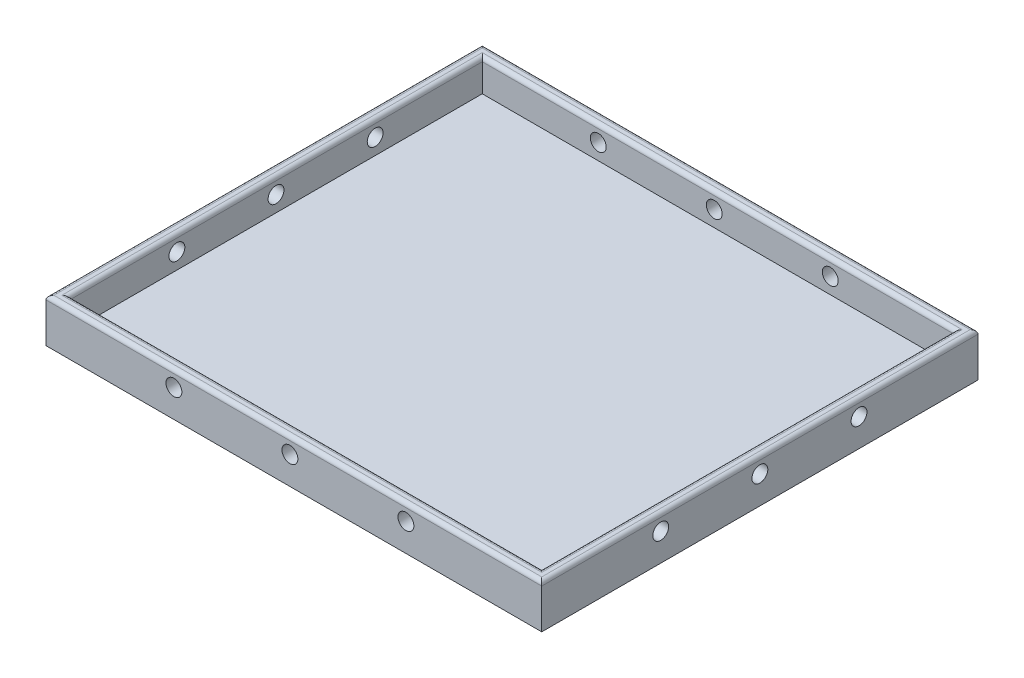
ISO-10303-21;
HEADER;
FILE_DESCRIPTION(('STEP AP214'),'2;1');
FILE_NAME('part.step','',(''),(''),'','','');
FILE_SCHEMA(('AUTOMOTIVE_DESIGN { 1 0 10303 214 1 1 1 1 }'));
ENDSEC;
DATA;
#1=APPLICATION_CONTEXT('core data for automotive mechanical design processes');
#2=APPLICATION_PROTOCOL_DEFINITION('international standard','automotive_design',2000,#1);
#3=PRODUCT_CONTEXT('',#1,'mechanical');
#4=PRODUCT('Part','Part','',(#3));
#5=PRODUCT_RELATED_PRODUCT_CATEGORY('part','',(#4));
#6=PRODUCT_DEFINITION_FORMATION('','',#4);
#7=PRODUCT_DEFINITION_CONTEXT('part definition',#1,'design');
#8=PRODUCT_DEFINITION('design','',#6,#7);
#9=PRODUCT_DEFINITION_SHAPE('','',#8);
#10=(LENGTH_UNIT() NAMED_UNIT(*) SI_UNIT(.MILLI.,.METRE.));
#11=(NAMED_UNIT(*) PLANE_ANGLE_UNIT() SI_UNIT($,.RADIAN.));
#12=(NAMED_UNIT(*) SI_UNIT($,.STERADIAN.) SOLID_ANGLE_UNIT());
#13=UNCERTAINTY_MEASURE_WITH_UNIT(LENGTH_MEASURE(1.E-05),#10,'distance_accuracy_value','');
#14=(GEOMETRIC_REPRESENTATION_CONTEXT(3) GLOBAL_UNCERTAINTY_ASSIGNED_CONTEXT((#13)) GLOBAL_UNIT_ASSIGNED_CONTEXT((#10,
#11,#12)) REPRESENTATION_CONTEXT('',''));
#15=CARTESIAN_POINT('',(0.,0.,0.));
#16=DIRECTION('',(0.,0.,1.));
#17=DIRECTION('',(1.,0.,0.));
#18=AXIS2_PLACEMENT_3D('',#15,#16,#17);
#19=CARTESIAN_POINT('',(-201.609907120743,11.,-77.8947368421052));
#20=DIRECTION('',(1.,0.,0.));
#21=DIRECTION('',(0.,0.,-1.));
#22=AXIS2_PLACEMENT_3D('',#19,#20,#21);
#23=PLANE('',#22);
#24=CARTESIAN_POINT('',(-201.609907120743,6.99999995326219,2.10526315789477));
#25=DIRECTION('',(1.,0.,0.));
#26=DIRECTION('',(0.,0.,-1.));
#27=AXIS2_PLACEMENT_3D('',#24,#25,#26);
#28=CIRCLE('',#27,2.);
#29=CARTESIAN_POINT('',(-201.609907120743,6.99999995326219,0.105263157894766));
#30=VERTEX_POINT('',#29);
#31=EDGE_CURVE('E191',#30,#30,#28,.T.);
#32=ORIENTED_EDGE('',*,*,#31,.T.);
#33=EDGE_LOOP('',(#32));
#34=FACE_BOUND('',#33,.T.);
#35=CARTESIAN_POINT('',(-201.609907120743,6.99999995326219,-22.8947368421052));
#36=DIRECTION('',(1.,0.,0.));
#37=DIRECTION('',(0.,0.,-1.));
#38=AXIS2_PLACEMENT_3D('',#35,#36,#37);
#39=CIRCLE('',#38,2.);
#40=CARTESIAN_POINT('',(-201.609907120743,6.99999995326219,-24.8947368421052));
#41=VERTEX_POINT('',#40);
#42=EDGE_CURVE('E594',#41,#41,#39,.T.);
#43=ORIENTED_EDGE('',*,*,#42,.T.);
#44=EDGE_LOOP('',(#43));
#45=FACE_BOUND('',#44,.T.);
#46=CARTESIAN_POINT('',(-201.609907120743,7.,-47.8947368421052));
#47=DIRECTION('',(1.,0.,0.));
#48=DIRECTION('',(0.,0.,-1.));
#49=AXIS2_PLACEMENT_3D('',#46,#47,#48);
#50=CIRCLE('',#49,2.);
#51=CARTESIAN_POINT('',(-201.609907120743,7.,-49.8947368421052));
#52=VERTEX_POINT('',#51);
#53=EDGE_CURVE('E587',#52,#52,#50,.T.);
#54=ORIENTED_EDGE('',*,*,#53,.T.);
#55=EDGE_LOOP('',(#54));
#56=FACE_BOUND('',#55,.T.);
#57=DIRECTION('',(0.,-1.,0.));
#58=VECTOR('',#57,1.);
#59=CARTESIAN_POINT('',(-201.609907120743,11.,32.1052631578948));
#60=LINE('',#59,#58);
#61=CARTESIAN_POINT('',(-201.609907120743,10.,32.1052631578948));
#62=VERTEX_POINT('',#61);
#63=CARTESIAN_POINT('',(-201.609907120743,0.,32.1052631578948));
#64=VERTEX_POINT('',#63);
#65=EDGE_CURVE('E184',#62,#64,#60,.T.);
#66=ORIENTED_EDGE('',*,*,#65,.F.);
#67=DIRECTION('',(0.,0.,1.));
#68=VECTOR('',#67,1.);
#69=CARTESIAN_POINT('',(-201.609907120743,10.,-77.8947368421052));
#70=LINE('',#69,#68);
#71=CARTESIAN_POINT('',(-201.609907120743,10.,-77.8947368421052));
#72=VERTEX_POINT('',#71);
#73=EDGE_CURVE('E45',#62,#72,#70,.F.);
#74=ORIENTED_EDGE('',*,*,#73,.T.);
#75=DIRECTION('',(0.,-1.,0.));
#76=VECTOR('',#75,1.);
#77=CARTESIAN_POINT('',(-201.609907120743,11.,-77.8947368421052));
#78=LINE('',#77,#76);
#79=CARTESIAN_POINT('',(-201.609907120743,0.,-77.8947368421052));
#80=VERTEX_POINT('',#79);
#81=EDGE_CURVE('E178',#72,#80,#78,.T.);
#82=ORIENTED_EDGE('',*,*,#81,.T.);
#83=DIRECTION('',(0.,0.,1.));
#84=VECTOR('',#83,1.);
#85=CARTESIAN_POINT('',(-201.609907120743,0.,-77.8947368421052));
#86=LINE('',#85,#84);
#87=EDGE_CURVE('E163',#80,#64,#86,.T.);
#88=ORIENTED_EDGE('',*,*,#87,.T.);
#89=EDGE_LOOP('',(#66,#74,#82,#88));
#90=FACE_BOUND('',#89,.T.);
#91=ADVANCED_FACE('F36',(#34,#45,#56,#90),#23,.F.);
#92=CARTESIAN_POINT('',(-201.609907120743,11.,32.1052631578948));
#93=DIRECTION('',(0.,0.,-1.));
#94=DIRECTION('',(-1.,0.,0.));
#95=AXIS2_PLACEMENT_3D('',#92,#93,#94);
#96=PLANE('',#95);
#97=CARTESIAN_POINT('',(-169.359907120743,7.,32.1052631578948));
#98=DIRECTION('',(0.,0.,1.));
#99=DIRECTION('',(1.,0.,0.));
#100=AXIS2_PLACEMENT_3D('',#97,#98,#99);
#101=CIRCLE('',#100,2.);
#102=CARTESIAN_POINT('',(-167.359907120743,7.,32.1052631578948));
#103=VERTEX_POINT('',#102);
#104=EDGE_CURVE('E622',#103,#103,#101,.T.);
#105=ORIENTED_EDGE('',*,*,#104,.F.);
#106=EDGE_LOOP('',(#105));
#107=FACE_BOUND('',#106,.T.);
#108=CARTESIAN_POINT('',(-140.109907120743,7.,32.1052631578948));
#109=DIRECTION('',(0.,0.,1.));
#110=DIRECTION('',(1.,0.,0.));
#111=AXIS2_PLACEMENT_3D('',#108,#109,#110);
#112=CIRCLE('',#111,2.);
#113=CARTESIAN_POINT('',(-138.109907120743,7.,32.1052631578948));
#114=VERTEX_POINT('',#113);
#115=EDGE_CURVE('E616',#114,#114,#112,.T.);
#116=ORIENTED_EDGE('',*,*,#115,.F.);
#117=EDGE_LOOP('',(#116));
#118=FACE_BOUND('',#117,.T.);
#119=CARTESIAN_POINT('',(-110.859907120743,7.,32.1052631578948));
#120=DIRECTION('',(0.,0.,1.));
#121=DIRECTION('',(1.,0.,0.));
#122=AXIS2_PLACEMENT_3D('',#119,#120,#121);
#123=CIRCLE('',#122,2.);
#124=CARTESIAN_POINT('',(-108.859907120743,7.,32.1052631578948));
#125=VERTEX_POINT('',#124);
#126=EDGE_CURVE('E250',#125,#125,#123,.T.);
#127=ORIENTED_EDGE('',*,*,#126,.F.);
#128=EDGE_LOOP('',(#127));
#129=FACE_BOUND('',#128,.T.);
#130=DIRECTION('',(0.,-1.,0.));
#131=VECTOR('',#130,1.);
#132=CARTESIAN_POINT('',(-76.6099071207431,11.,32.1052631578948));
#133=LINE('',#132,#131);
#134=CARTESIAN_POINT('',(-76.6099071207431,10.,32.1052631578948));
#135=VERTEX_POINT('',#134);
#136=CARTESIAN_POINT('',(-76.6099071207431,0.,32.1052631578948));
#137=VERTEX_POINT('',#136);
#138=EDGE_CURVE('E182',#135,#137,#133,.T.);
#139=ORIENTED_EDGE('',*,*,#138,.F.);
#140=DIRECTION('',(1.,0.,0.));
#141=VECTOR('',#140,1.);
#142=CARTESIAN_POINT('',(-201.609907120743,10.,32.1052631578948));
#143=LINE('',#142,#141);
#144=EDGE_CURVE('E230',#135,#62,#143,.F.);
#145=ORIENTED_EDGE('',*,*,#144,.T.);
#146=ORIENTED_EDGE('',*,*,#65,.T.);
#147=DIRECTION('',(1.,0.,0.));
#148=VECTOR('',#147,1.);
#149=CARTESIAN_POINT('',(-201.609907120743,0.,32.1052631578948));
#150=LINE('',#149,#148);
#151=EDGE_CURVE('E169',#64,#137,#150,.T.);
#152=ORIENTED_EDGE('',*,*,#151,.T.);
#153=EDGE_LOOP('',(#139,#145,#146,#152));
#154=FACE_BOUND('',#153,.T.);
#155=ADVANCED_FACE('F282',(#107,#118,#129,#154),#96,.F.);
#156=CARTESIAN_POINT('',(-76.6099071207431,11.,-77.8947368421052));
#157=DIRECTION('',(-1.,0.,0.));
#158=DIRECTION('',(0.,0.,1.));
#159=AXIS2_PLACEMENT_3D('',#156,#157,#158);
#160=PLANE('',#159);
#161=CARTESIAN_POINT('',(-76.6099071207431,6.99999995326219,2.10526315789477));
#162=DIRECTION('',(1.,0.,0.));
#163=DIRECTION('',(0.,0.,-1.));
#164=AXIS2_PLACEMENT_3D('',#161,#162,#163);
#165=CIRCLE('',#164,2.);
#166=CARTESIAN_POINT('',(-76.6099071207431,6.99999995326219,0.105263157894766));
#167=VERTEX_POINT('',#166);
#168=EDGE_CURVE('E579',#167,#167,#165,.T.);
#169=ORIENTED_EDGE('',*,*,#168,.F.);
#170=EDGE_LOOP('',(#169));
#171=FACE_BOUND('',#170,.T.);
#172=CARTESIAN_POINT('',(-76.6099071207431,6.99999995326219,-22.8947368421052));
#173=DIRECTION('',(1.,0.,0.));
#174=DIRECTION('',(0.,0.,-1.));
#175=AXIS2_PLACEMENT_3D('',#172,#173,#174);
#176=CIRCLE('',#175,2.);
#177=CARTESIAN_POINT('',(-76.6099071207431,6.99999995326219,-24.8947368421052));
#178=VERTEX_POINT('',#177);
#179=EDGE_CURVE('E583',#178,#178,#176,.T.);
#180=ORIENTED_EDGE('',*,*,#179,.F.);
#181=EDGE_LOOP('',(#180));
#182=FACE_BOUND('',#181,.T.);
#183=CARTESIAN_POINT('',(-76.6099071207431,7.,-47.8947368421052));
#184=DIRECTION('',(1.,0.,0.));
#185=DIRECTION('',(0.,0.,-1.));
#186=AXIS2_PLACEMENT_3D('',#183,#184,#185);
#187=CIRCLE('',#186,2.);
#188=CARTESIAN_POINT('',(-76.6099071207431,7.,-49.8947368421052));
#189=VERTEX_POINT('',#188);
#190=EDGE_CURVE('E586',#189,#189,#187,.T.);
#191=ORIENTED_EDGE('',*,*,#190,.F.);
#192=EDGE_LOOP('',(#191));
#193=FACE_BOUND('',#192,.T.);
#194=DIRECTION('',(0.,-1.,0.));
#195=VECTOR('',#194,1.);
#196=CARTESIAN_POINT('',(-76.6099071207431,11.,-77.8947368421052));
#197=LINE('',#196,#195);
#198=CARTESIAN_POINT('',(-76.6099071207431,10.,-77.8947368421052));
#199=VERTEX_POINT('',#198);
#200=CARTESIAN_POINT('',(-76.6099071207431,0.,-77.8947368421052));
#201=VERTEX_POINT('',#200);
#202=EDGE_CURVE('E180',#199,#201,#197,.T.);
#203=ORIENTED_EDGE('',*,*,#202,.F.);
#204=DIRECTION('',(0.,0.,-1.));
#205=VECTOR('',#204,1.);
#206=CARTESIAN_POINT('',(-76.6099071207431,10.,32.1052631578948));
#207=LINE('',#206,#205);
#208=EDGE_CURVE('E233',#199,#135,#207,.F.);
#209=ORIENTED_EDGE('',*,*,#208,.T.);
#210=ORIENTED_EDGE('',*,*,#138,.T.);
#211=DIRECTION('',(0.,0.,-1.));
#212=VECTOR('',#211,1.);
#213=CARTESIAN_POINT('',(-76.6099071207431,0.,-77.8947368421052));
#214=LINE('',#213,#212);
#215=EDGE_CURVE('E172',#137,#201,#214,.T.);
#216=ORIENTED_EDGE('',*,*,#215,.T.);
#217=EDGE_LOOP('',(#203,#209,#210,#216));
#218=FACE_BOUND('',#217,.T.);
#219=ADVANCED_FACE('F273',(#171,#182,#193,#218),#160,.F.);
#220=CARTESIAN_POINT('',(-201.609907120743,11.,-77.8947368421052));
#221=DIRECTION('',(0.,0.,1.));
#222=DIRECTION('',(1.,0.,0.));
#223=AXIS2_PLACEMENT_3D('',#220,#221,#222);
#224=PLANE('',#223);
#225=CARTESIAN_POINT('',(-169.359907120743,7.,-77.8947368421052));
#226=DIRECTION('',(0.,0.,1.));
#227=DIRECTION('',(1.,0.,0.));
#228=AXIS2_PLACEMENT_3D('',#225,#226,#227);
#229=CIRCLE('',#228,2.);
#230=CARTESIAN_POINT('',(-167.359907120743,7.,-77.8947368421052));
#231=VERTEX_POINT('',#230);
#232=EDGE_CURVE('E202',#231,#231,#229,.T.);
#233=ORIENTED_EDGE('',*,*,#232,.T.);
#234=EDGE_LOOP('',(#233));
#235=FACE_BOUND('',#234,.T.);
#236=CARTESIAN_POINT('',(-140.109907120743,7.,-77.8947368421052));
#237=DIRECTION('',(0.,0.,1.));
#238=DIRECTION('',(1.,0.,0.));
#239=AXIS2_PLACEMENT_3D('',#236,#237,#238);
#240=CIRCLE('',#239,2.);
#241=CARTESIAN_POINT('',(-138.109907120743,7.,-77.8947368421052));
#242=VERTEX_POINT('',#241);
#243=EDGE_CURVE('E619',#242,#242,#240,.T.);
#244=ORIENTED_EDGE('',*,*,#243,.T.);
#245=EDGE_LOOP('',(#244));
#246=FACE_BOUND('',#245,.T.);
#247=CARTESIAN_POINT('',(-110.859907120743,7.,-77.8947368421052));
#248=DIRECTION('',(0.,0.,1.));
#249=DIRECTION('',(1.,0.,0.));
#250=AXIS2_PLACEMENT_3D('',#247,#248,#249);
#251=CIRCLE('',#250,2.);
#252=CARTESIAN_POINT('',(-108.859907120743,7.,-77.8947368421052));
#253=VERTEX_POINT('',#252);
#254=EDGE_CURVE('E613',#253,#253,#251,.T.);
#255=ORIENTED_EDGE('',*,*,#254,.T.);
#256=EDGE_LOOP('',(#255));
#257=FACE_BOUND('',#256,.T.);
#258=ORIENTED_EDGE('',*,*,#81,.F.);
#259=DIRECTION('',(-1.,0.,0.));
#260=VECTOR('',#259,1.);
#261=CARTESIAN_POINT('',(-76.6099071207431,10.,-77.8947368421052));
#262=LINE('',#261,#260);
#263=EDGE_CURVE('E11',#72,#199,#262,.F.);
#264=ORIENTED_EDGE('',*,*,#263,.T.);
#265=ORIENTED_EDGE('',*,*,#202,.T.);
#266=DIRECTION('',(-1.,0.,0.));
#267=VECTOR('',#266,1.);
#268=CARTESIAN_POINT('',(-201.609907120743,0.,-77.8947368421052));
#269=LINE('',#268,#267);
#270=EDGE_CURVE('E175',#201,#80,#269,.T.);
#271=ORIENTED_EDGE('',*,*,#270,.T.);
#272=EDGE_LOOP('',(#258,#264,#265,#271));
#273=FACE_BOUND('',#272,.T.);
#274=ADVANCED_FACE('F271',(#235,#246,#257,#273),#224,.F.);
#275=CARTESIAN_POINT('',(0.,11.,0.));
#276=DIRECTION('',(0.,1.,0.));
#277=DIRECTION('',(0.,0.,1.));
#278=AXIS2_PLACEMENT_3D('',#275,#276,#277);
#279=PLANE('',#278);
#280=DIRECTION('',(0.,0.,-1.));
#281=VECTOR('',#280,1.);
#282=CARTESIAN_POINT('',(-78.6099071207431,11.,29.1052631578948));
#283=LINE('',#282,#281);
#284=CARTESIAN_POINT('',(-78.6099071207431,11.,-75.8947368421052));
#285=VERTEX_POINT('',#284);
#286=CARTESIAN_POINT('',(-78.6099071207431,11.,30.1052631578948));
#287=VERTEX_POINT('',#286);
#288=EDGE_CURVE('E225',#285,#287,#283,.F.);
#289=ORIENTED_EDGE('',*,*,#288,.T.);
#290=DIRECTION('',(1.,0.,0.));
#291=VECTOR('',#290,1.);
#292=CARTESIAN_POINT('',(-198.609907120743,11.,30.1052631578948));
#293=LINE('',#292,#291);
#294=CARTESIAN_POINT('',(-199.609907120743,11.,30.1052631578948));
#295=VERTEX_POINT('',#294);
#296=EDGE_CURVE('E227',#287,#295,#293,.F.);
#297=ORIENTED_EDGE('',*,*,#296,.T.);
#298=DIRECTION('',(0.,0.,1.));
#299=VECTOR('',#298,1.);
#300=CARTESIAN_POINT('',(-199.609907120743,11.,-74.8947368421052));
#301=LINE('',#300,#299);
#302=CARTESIAN_POINT('',(-199.609907120743,11.,-75.8947368421052));
#303=VERTEX_POINT('',#302);
#304=EDGE_CURVE('E223',#295,#303,#301,.F.);
#305=ORIENTED_EDGE('',*,*,#304,.T.);
#306=DIRECTION('',(-1.,0.,0.));
#307=VECTOR('',#306,1.);
#308=CARTESIAN_POINT('',(-79.6099071207431,11.,-75.8947368421052));
#309=LINE('',#308,#307);
#310=EDGE_CURVE('E221',#303,#285,#309,.F.);
#311=ORIENTED_EDGE('',*,*,#310,.T.);
#312=EDGE_LOOP('',(#289,#297,#305,#311));
#313=FACE_BOUND('',#312,.T.);
#314=DIRECTION('',(0.,0.,1.));
#315=VECTOR('',#314,1.);
#316=CARTESIAN_POINT('',(-200.609907120743,11.,32.1052631578948));
#317=LINE('',#316,#315);
#318=CARTESIAN_POINT('',(-200.609907120743,11.,-76.8947368421052));
#319=VERTEX_POINT('',#318);
#320=CARTESIAN_POINT('',(-200.609907120743,11.,31.1052631578948));
#321=VERTEX_POINT('',#320);
#322=EDGE_CURVE('E214',#319,#321,#317,.T.);
#323=ORIENTED_EDGE('',*,*,#322,.T.);
#324=DIRECTION('',(1.,0.,0.));
#325=VECTOR('',#324,1.);
#326=CARTESIAN_POINT('',(-76.6099071207431,11.,31.1052631578948));
#327=LINE('',#326,#325);
#328=CARTESIAN_POINT('',(-77.6099071207431,11.,31.1052631578948));
#329=VERTEX_POINT('',#328);
#330=EDGE_CURVE('E218',#321,#329,#327,.T.);
#331=ORIENTED_EDGE('',*,*,#330,.T.);
#332=DIRECTION('',(0.,0.,-1.));
#333=VECTOR('',#332,1.);
#334=CARTESIAN_POINT('',(-77.6099071207431,11.,-77.8947368421052));
#335=LINE('',#334,#333);
#336=CARTESIAN_POINT('',(-77.6099071207431,11.,-76.8947368421052));
#337=VERTEX_POINT('',#336);
#338=EDGE_CURVE('E216',#329,#337,#335,.T.);
#339=ORIENTED_EDGE('',*,*,#338,.T.);
#340=DIRECTION('',(-1.,0.,0.));
#341=VECTOR('',#340,1.);
#342=CARTESIAN_POINT('',(-201.609907120743,11.,-76.8947368421052));
#343=LINE('',#342,#341);
#344=EDGE_CURVE('E212',#337,#319,#343,.T.);
#345=ORIENTED_EDGE('',*,*,#344,.T.);
#346=EDGE_LOOP('',(#323,#331,#339,#345));
#347=FACE_BOUND('',#346,.T.);
#348=ADVANCED_FACE('F290',(#313,#347),#279,.T.);
#349=CARTESIAN_POINT('',(0.,0.,0.));
#350=DIRECTION('',(0.,1.,0.));
#351=DIRECTION('',(0.,0.,1.));
#352=AXIS2_PLACEMENT_3D('',#349,#350,#351);
#353=PLANE('',#352);
#354=ORIENTED_EDGE('',*,*,#87,.F.);
#355=ORIENTED_EDGE('',*,*,#270,.F.);
#356=ORIENTED_EDGE('',*,*,#215,.F.);
#357=ORIENTED_EDGE('',*,*,#151,.F.);
#358=EDGE_LOOP('',(#354,#355,#356,#357));
#359=FACE_BOUND('',#358,.T.);
#360=ADVANCED_FACE('F280',(#359),#353,.F.);
#361=CARTESIAN_POINT('',(-198.609907120743,3.,-74.8947368421052));
#362=DIRECTION('',(-1.,0.,0.));
#363=DIRECTION('',(0.,0.,1.));
#364=AXIS2_PLACEMENT_3D('',#361,#362,#363);
#365=PLANE('',#364);
#366=CARTESIAN_POINT('',(-198.609907120743,6.99999995326219,2.10526315789477));
#367=DIRECTION('',(-1.,0.,0.));
#368=DIRECTION('',(0.,0.,1.));
#369=AXIS2_PLACEMENT_3D('',#366,#367,#368);
#370=CIRCLE('',#369,2.);
#371=CARTESIAN_POINT('',(-198.609907120743,6.99999995326219,4.10526315789477));
#372=VERTEX_POINT('',#371);
#373=EDGE_CURVE('E152',#372,#372,#370,.T.);
#374=ORIENTED_EDGE('',*,*,#373,.T.);
#375=EDGE_LOOP('',(#374));
#376=FACE_BOUND('',#375,.T.);
#377=CARTESIAN_POINT('',(-198.609907120743,6.99999995326219,-22.8947368421052));
#378=DIRECTION('',(-1.,0.,0.));
#379=DIRECTION('',(0.,0.,1.));
#380=AXIS2_PLACEMENT_3D('',#377,#378,#379);
#381=CIRCLE('',#380,2.);
#382=CARTESIAN_POINT('',(-198.609907120743,6.99999995326219,-20.8947368421052));
#383=VERTEX_POINT('',#382);
#384=EDGE_CURVE('E195',#383,#383,#381,.T.);
#385=ORIENTED_EDGE('',*,*,#384,.T.);
#386=EDGE_LOOP('',(#385));
#387=FACE_BOUND('',#386,.T.);
#388=CARTESIAN_POINT('',(-198.609907120743,7.,-47.8947368421052));
#389=DIRECTION('',(-1.,0.,0.));
#390=DIRECTION('',(0.,0.,1.));
#391=AXIS2_PLACEMENT_3D('',#388,#389,#390);
#392=CIRCLE('',#391,2.);
#393=CARTESIAN_POINT('',(-198.609907120743,7.,-45.8947368421052));
#394=VERTEX_POINT('',#393);
#395=EDGE_CURVE('E190',#394,#394,#392,.T.);
#396=ORIENTED_EDGE('',*,*,#395,.T.);
#397=EDGE_LOOP('',(#396));
#398=FACE_BOUND('',#397,.T.);
#399=DIRECTION('',(0.,1.,0.));
#400=VECTOR('',#399,1.);
#401=CARTESIAN_POINT('',(-198.609907120743,3.,-74.8947368421052));
#402=LINE('',#401,#400);
#403=CARTESIAN_POINT('',(-198.609907120743,3.,-74.8947368421052));
#404=VERTEX_POINT('',#403);
#405=CARTESIAN_POINT('',(-198.609907120743,10.,-74.8947368421052));
#406=VERTEX_POINT('',#405);
#407=EDGE_CURVE('E161',#404,#406,#402,.T.);
#408=ORIENTED_EDGE('',*,*,#407,.T.);
#409=DIRECTION('',(0.,0.,1.));
#410=VECTOR('',#409,1.);
#411=CARTESIAN_POINT('',(-198.609907120743,10.,29.1052631578948));
#412=LINE('',#411,#410);
#413=CARTESIAN_POINT('',(-198.609907120743,10.,29.1052631578948));
#414=VERTEX_POINT('',#413);
#415=EDGE_CURVE('E134',#406,#414,#412,.T.);
#416=ORIENTED_EDGE('',*,*,#415,.T.);
#417=DIRECTION('',(0.,1.,0.));
#418=VECTOR('',#417,1.);
#419=CARTESIAN_POINT('',(-198.609907120743,3.,29.1052631578948));
#420=LINE('',#419,#418);
#421=CARTESIAN_POINT('',(-198.609907120743,3.,29.1052631578948));
#422=VERTEX_POINT('',#421);
#423=EDGE_CURVE('E127',#422,#414,#420,.T.);
#424=ORIENTED_EDGE('',*,*,#423,.F.);
#425=DIRECTION('',(0.,0.,1.));
#426=VECTOR('',#425,1.);
#427=CARTESIAN_POINT('',(-198.609907120743,3.,-74.8947368421052));
#428=LINE('',#427,#426);
#429=EDGE_CURVE('E131',#404,#422,#428,.T.);
#430=ORIENTED_EDGE('',*,*,#429,.F.);
#431=EDGE_LOOP('',(#408,#416,#424,#430));
#432=FACE_BOUND('',#431,.T.);
#433=ADVANCED_FACE('F129',(#376,#387,#398,#432),#365,.F.);
#434=CARTESIAN_POINT('',(-198.609907120743,3.,-74.8947368421052));
#435=DIRECTION('',(0.,0.,-1.));
#436=DIRECTION('',(-1.,0.,0.));
#437=AXIS2_PLACEMENT_3D('',#434,#435,#436);
#438=PLANE('',#437);
#439=CARTESIAN_POINT('',(-169.359907120743,7.,-74.8947368421052));
#440=DIRECTION('',(0.,0.,-1.));
#441=DIRECTION('',(-1.,0.,0.));
#442=AXIS2_PLACEMENT_3D('',#439,#440,#441);
#443=CIRCLE('',#442,2.);
#444=CARTESIAN_POINT('',(-171.359907120743,7.,-74.8947368421052));
#445=VERTEX_POINT('',#444);
#446=EDGE_CURVE('E210',#445,#445,#443,.T.);
#447=ORIENTED_EDGE('',*,*,#446,.T.);
#448=EDGE_LOOP('',(#447));
#449=FACE_BOUND('',#448,.T.);
#450=CARTESIAN_POINT('',(-140.109907120743,7.,-74.8947368421052));
#451=DIRECTION('',(0.,0.,-1.));
#452=DIRECTION('',(-1.,0.,0.));
#453=AXIS2_PLACEMENT_3D('',#450,#451,#452);
#454=CIRCLE('',#453,2.);
#455=CARTESIAN_POINT('',(-142.109907120743,7.,-74.8947368421052));
#456=VERTEX_POINT('',#455);
#457=EDGE_CURVE('E206',#456,#456,#454,.T.);
#458=ORIENTED_EDGE('',*,*,#457,.T.);
#459=EDGE_LOOP('',(#458));
#460=FACE_BOUND('',#459,.T.);
#461=CARTESIAN_POINT('',(-110.859907120743,7.,-74.8947368421052));
#462=DIRECTION('',(0.,0.,-1.));
#463=DIRECTION('',(-1.,0.,0.));
#464=AXIS2_PLACEMENT_3D('',#461,#462,#463);
#465=CIRCLE('',#464,2.);
#466=CARTESIAN_POINT('',(-112.859907120743,7.,-74.8947368421052));
#467=VERTEX_POINT('',#466);
#468=EDGE_CURVE('E201',#467,#467,#465,.T.);
#469=ORIENTED_EDGE('',*,*,#468,.T.);
#470=EDGE_LOOP('',(#469));
#471=FACE_BOUND('',#470,.T.);
#472=DIRECTION('',(0.,1.,0.));
#473=VECTOR('',#472,1.);
#474=CARTESIAN_POINT('',(-79.6099071207431,3.,-74.8947368421052));
#475=LINE('',#474,#473);
#476=CARTESIAN_POINT('',(-79.6099071207431,3.,-74.8947368421052));
#477=VERTEX_POINT('',#476);
#478=CARTESIAN_POINT('',(-79.6099071207431,10.,-74.8947368421052));
#479=VERTEX_POINT('',#478);
#480=EDGE_CURVE('E164',#477,#479,#475,.T.);
#481=ORIENTED_EDGE('',*,*,#480,.T.);
#482=DIRECTION('',(-1.,0.,0.));
#483=VECTOR('',#482,1.);
#484=CARTESIAN_POINT('',(-198.609907120743,10.,-74.8947368421052));
#485=LINE('',#484,#483);
#486=EDGE_CURVE('E60',#479,#406,#485,.T.);
#487=ORIENTED_EDGE('',*,*,#486,.T.);
#488=ORIENTED_EDGE('',*,*,#407,.F.);
#489=DIRECTION('',(-1.,0.,0.));
#490=VECTOR('',#489,1.);
#491=CARTESIAN_POINT('',(-198.609907120743,3.,-74.8947368421052));
#492=LINE('',#491,#490);
#493=EDGE_CURVE('E139',#477,#404,#492,.T.);
#494=ORIENTED_EDGE('',*,*,#493,.F.);
#495=EDGE_LOOP('',(#481,#487,#488,#494));
#496=FACE_BOUND('',#495,.T.);
#497=ADVANCED_FACE('F466',(#449,#460,#471,#496),#438,.F.);
#498=CARTESIAN_POINT('',(-79.6099071207431,3.,-74.8947368421052));
#499=DIRECTION('',(1.,0.,0.));
#500=DIRECTION('',(0.,0.,-1.));
#501=AXIS2_PLACEMENT_3D('',#498,#499,#500);
#502=PLANE('',#501);
#503=CARTESIAN_POINT('',(-79.6099071207431,6.99999995326219,2.10526315789477));
#504=DIRECTION('',(1.,0.,0.));
#505=DIRECTION('',(0.,0.,-1.));
#506=AXIS2_PLACEMENT_3D('',#503,#504,#505);
#507=CIRCLE('',#506,2.);
#508=CARTESIAN_POINT('',(-79.6099071207431,6.99999995326219,0.105263157894766));
#509=VERTEX_POINT('',#508);
#510=EDGE_CURVE('E155',#509,#509,#507,.T.);
#511=ORIENTED_EDGE('',*,*,#510,.T.);
#512=EDGE_LOOP('',(#511));
#513=FACE_BOUND('',#512,.T.);
#514=CARTESIAN_POINT('',(-79.6099071207431,6.99999995326219,-22.8947368421052));
#515=DIRECTION('',(1.,0.,0.));
#516=DIRECTION('',(0.,0.,-1.));
#517=AXIS2_PLACEMENT_3D('',#514,#515,#516);
#518=CIRCLE('',#517,2.);
#519=CARTESIAN_POINT('',(-79.6099071207431,6.99999995326219,-24.8947368421052));
#520=VERTEX_POINT('',#519);
#521=EDGE_CURVE('E192',#520,#520,#518,.T.);
#522=ORIENTED_EDGE('',*,*,#521,.T.);
#523=EDGE_LOOP('',(#522));
#524=FACE_BOUND('',#523,.T.);
#525=CARTESIAN_POINT('',(-79.6099071207431,7.,-47.8947368421052));
#526=DIRECTION('',(1.,0.,0.));
#527=DIRECTION('',(0.,0.,-1.));
#528=AXIS2_PLACEMENT_3D('',#525,#526,#527);
#529=CIRCLE('',#528,2.);
#530=CARTESIAN_POINT('',(-79.6099071207431,7.,-49.8947368421052));
#531=VERTEX_POINT('',#530);
#532=EDGE_CURVE('E187',#531,#531,#529,.T.);
#533=ORIENTED_EDGE('',*,*,#532,.T.);
#534=EDGE_LOOP('',(#533));
#535=FACE_BOUND('',#534,.T.);
#536=DIRECTION('',(0.,1.,0.));
#537=VECTOR('',#536,1.);
#538=CARTESIAN_POINT('',(-79.6099071207431,3.,29.1052631578948));
#539=LINE('',#538,#537);
#540=CARTESIAN_POINT('',(-79.6099071207431,3.,29.1052631578948));
#541=VERTEX_POINT('',#540);
#542=CARTESIAN_POINT('',(-79.6099071207431,10.,29.1052631578948));
#543=VERTEX_POINT('',#542);
#544=EDGE_CURVE('E138',#541,#543,#539,.T.);
#545=ORIENTED_EDGE('',*,*,#544,.T.);
#546=DIRECTION('',(0.,0.,-1.));
#547=VECTOR('',#546,1.);
#548=CARTESIAN_POINT('',(-79.6099071207431,10.,-74.8947368421052));
#549=LINE('',#548,#547);
#550=EDGE_CURVE('E235',#543,#479,#549,.T.);
#551=ORIENTED_EDGE('',*,*,#550,.T.);
#552=ORIENTED_EDGE('',*,*,#480,.F.);
#553=DIRECTION('',(0.,0.,-1.));
#554=VECTOR('',#553,1.);
#555=CARTESIAN_POINT('',(-79.6099071207431,3.,-74.8947368421052));
#556=LINE('',#555,#554);
#557=EDGE_CURVE('E148',#541,#477,#556,.T.);
#558=ORIENTED_EDGE('',*,*,#557,.F.);
#559=EDGE_LOOP('',(#545,#551,#552,#558));
#560=FACE_BOUND('',#559,.T.);
#561=ADVANCED_FACE('F458',(#513,#524,#535,#560),#502,.F.);
#562=CARTESIAN_POINT('',(-198.609907120743,3.,29.1052631578948));
#563=DIRECTION('',(0.,0.,1.));
#564=DIRECTION('',(1.,0.,0.));
#565=AXIS2_PLACEMENT_3D('',#562,#563,#564);
#566=PLANE('',#565);
#567=CARTESIAN_POINT('',(-169.359907120743,7.,29.1052631578948));
#568=DIRECTION('',(0.,0.,1.));
#569=DIRECTION('',(1.,0.,0.));
#570=AXIS2_PLACEMENT_3D('',#567,#568,#569);
#571=CIRCLE('',#570,2.);
#572=CARTESIAN_POINT('',(-167.359907120743,7.,29.1052631578948));
#573=VERTEX_POINT('',#572);
#574=EDGE_CURVE('E207',#573,#573,#571,.T.);
#575=ORIENTED_EDGE('',*,*,#574,.T.);
#576=EDGE_LOOP('',(#575));
#577=FACE_BOUND('',#576,.T.);
#578=CARTESIAN_POINT('',(-140.109907120743,7.,29.1052631578948));
#579=DIRECTION('',(0.,0.,1.));
#580=DIRECTION('',(1.,0.,0.));
#581=AXIS2_PLACEMENT_3D('',#578,#579,#580);
#582=CIRCLE('',#581,2.);
#583=CARTESIAN_POINT('',(-138.109907120743,7.,29.1052631578948));
#584=VERTEX_POINT('',#583);
#585=EDGE_CURVE('E203',#584,#584,#582,.T.);
#586=ORIENTED_EDGE('',*,*,#585,.T.);
#587=EDGE_LOOP('',(#586));
#588=FACE_BOUND('',#587,.T.);
#589=CARTESIAN_POINT('',(-110.859907120743,7.,29.1052631578948));
#590=DIRECTION('',(0.,0.,1.));
#591=DIRECTION('',(1.,0.,0.));
#592=AXIS2_PLACEMENT_3D('',#589,#590,#591);
#593=CIRCLE('',#592,2.);
#594=CARTESIAN_POINT('',(-108.859907120743,7.,29.1052631578948));
#595=VERTEX_POINT('',#594);
#596=EDGE_CURVE('E198',#595,#595,#593,.T.);
#597=ORIENTED_EDGE('',*,*,#596,.T.);
#598=EDGE_LOOP('',(#597));
#599=FACE_BOUND('',#598,.T.);
#600=ORIENTED_EDGE('',*,*,#423,.T.);
#601=DIRECTION('',(1.,0.,0.));
#602=VECTOR('',#601,1.);
#603=CARTESIAN_POINT('',(-79.6099071207431,10.,29.1052631578948));
#604=LINE('',#603,#602);
#605=EDGE_CURVE('E186',#414,#543,#604,.T.);
#606=ORIENTED_EDGE('',*,*,#605,.T.);
#607=ORIENTED_EDGE('',*,*,#544,.F.);
#608=DIRECTION('',(1.,0.,0.));
#609=VECTOR('',#608,1.);
#610=CARTESIAN_POINT('',(-198.609907120743,3.,29.1052631578948));
#611=LINE('',#610,#609);
#612=EDGE_CURVE('E142',#422,#541,#611,.T.);
#613=ORIENTED_EDGE('',*,*,#612,.F.);
#614=EDGE_LOOP('',(#600,#606,#607,#613));
#615=FACE_BOUND('',#614,.T.);
#616=ADVANCED_FACE('F143',(#577,#588,#599,#615),#566,.F.);
#617=CARTESIAN_POINT('',(0.,3.,0.));
#618=DIRECTION('',(0.,1.,0.));
#619=DIRECTION('',(0.,0.,1.));
#620=AXIS2_PLACEMENT_3D('',#617,#618,#619);
#621=PLANE('',#620);
#622=ORIENTED_EDGE('',*,*,#429,.T.);
#623=ORIENTED_EDGE('',*,*,#612,.T.);
#624=ORIENTED_EDGE('',*,*,#557,.T.);
#625=ORIENTED_EDGE('',*,*,#493,.T.);
#626=EDGE_LOOP('',(#622,#623,#624,#625));
#627=FACE_BOUND('',#626,.T.);
#628=ADVANCED_FACE('F150',(#627),#621,.T.);
#629=CARTESIAN_POINT('',(-201.609907120743,7.,-47.8947368421052));
#630=DIRECTION('',(1.,0.,0.));
#631=DIRECTION('',(0.,0.,-1.));
#632=AXIS2_PLACEMENT_3D('',#629,#630,#631);
#633=CYLINDRICAL_SURFACE('',#632,2.);
#634=ORIENTED_EDGE('',*,*,#190,.T.);
#635=EDGE_LOOP('',(#634));
#636=FACE_BOUND('',#635,.T.);
#637=ORIENTED_EDGE('',*,*,#532,.F.);
#638=EDGE_LOOP('',(#637));
#639=FACE_BOUND('',#638,.T.);
#640=ADVANCED_FACE('F428',(#636,#639),#633,.F.);
#641=CARTESIAN_POINT('',(-201.609907120743,6.99999995326219,-22.8947368421052));
#642=DIRECTION('',(1.,0.,0.));
#643=DIRECTION('',(0.,0.,-1.));
#644=AXIS2_PLACEMENT_3D('',#641,#642,#643);
#645=CYLINDRICAL_SURFACE('',#644,2.);
#646=ORIENTED_EDGE('',*,*,#179,.T.);
#647=EDGE_LOOP('',(#646));
#648=FACE_BOUND('',#647,.T.);
#649=ORIENTED_EDGE('',*,*,#521,.F.);
#650=EDGE_LOOP('',(#649));
#651=FACE_BOUND('',#650,.T.);
#652=ADVANCED_FACE('F420',(#648,#651),#645,.F.);
#653=CARTESIAN_POINT('',(-201.609907120743,6.99999995326219,2.10526315789477));
#654=DIRECTION('',(1.,0.,0.));
#655=DIRECTION('',(0.,0.,-1.));
#656=AXIS2_PLACEMENT_3D('',#653,#654,#655);
#657=CYLINDRICAL_SURFACE('',#656,2.);
#658=ORIENTED_EDGE('',*,*,#168,.T.);
#659=EDGE_LOOP('',(#658));
#660=FACE_BOUND('',#659,.T.);
#661=ORIENTED_EDGE('',*,*,#510,.F.);
#662=EDGE_LOOP('',(#661));
#663=FACE_BOUND('',#662,.T.);
#664=ADVANCED_FACE('F411',(#660,#663),#657,.F.);
#665=ORIENTED_EDGE('',*,*,#53,.F.);
#666=EDGE_LOOP('',(#665));
#667=FACE_BOUND('',#666,.T.);
#668=ORIENTED_EDGE('',*,*,#395,.F.);
#669=EDGE_LOOP('',(#668));
#670=FACE_BOUND('',#669,.T.);
#671=ADVANCED_FACE('F417',(#667,#670),#633,.F.);
#672=ORIENTED_EDGE('',*,*,#42,.F.);
#673=EDGE_LOOP('',(#672));
#674=FACE_BOUND('',#673,.T.);
#675=ORIENTED_EDGE('',*,*,#384,.F.);
#676=EDGE_LOOP('',(#675));
#677=FACE_BOUND('',#676,.T.);
#678=ADVANCED_FACE('F408',(#674,#677),#645,.F.);
#679=ORIENTED_EDGE('',*,*,#31,.F.);
#680=EDGE_LOOP('',(#679));
#681=FACE_BOUND('',#680,.T.);
#682=ORIENTED_EDGE('',*,*,#373,.F.);
#683=EDGE_LOOP('',(#682));
#684=FACE_BOUND('',#683,.T.);
#685=ADVANCED_FACE('F401',(#681,#684),#657,.F.);
#686=CARTESIAN_POINT('',(-110.859907120743,7.,-77.8947368421052));
#687=DIRECTION('',(0.,0.,1.));
#688=DIRECTION('',(1.,0.,0.));
#689=AXIS2_PLACEMENT_3D('',#686,#687,#688);
#690=CYLINDRICAL_SURFACE('',#689,2.);
#691=ORIENTED_EDGE('',*,*,#126,.T.);
#692=EDGE_LOOP('',(#691));
#693=FACE_BOUND('',#692,.T.);
#694=ORIENTED_EDGE('',*,*,#596,.F.);
#695=EDGE_LOOP('',(#694));
#696=FACE_BOUND('',#695,.T.);
#697=ADVANCED_FACE('F383',(#693,#696),#690,.F.);
#698=CARTESIAN_POINT('',(-140.109907120743,7.,-77.8947368421052));
#699=DIRECTION('',(0.,0.,1.));
#700=DIRECTION('',(1.,0.,0.));
#701=AXIS2_PLACEMENT_3D('',#698,#699,#700);
#702=CYLINDRICAL_SURFACE('',#701,2.);
#703=ORIENTED_EDGE('',*,*,#115,.T.);
#704=EDGE_LOOP('',(#703));
#705=FACE_BOUND('',#704,.T.);
#706=ORIENTED_EDGE('',*,*,#585,.F.);
#707=EDGE_LOOP('',(#706));
#708=FACE_BOUND('',#707,.T.);
#709=ADVANCED_FACE('F375',(#705,#708),#702,.F.);
#710=CARTESIAN_POINT('',(-169.359907120743,7.,-77.8947368421052));
#711=DIRECTION('',(0.,0.,1.));
#712=DIRECTION('',(1.,0.,0.));
#713=AXIS2_PLACEMENT_3D('',#710,#711,#712);
#714=CYLINDRICAL_SURFACE('',#713,2.);
#715=ORIENTED_EDGE('',*,*,#104,.T.);
#716=EDGE_LOOP('',(#715));
#717=FACE_BOUND('',#716,.T.);
#718=ORIENTED_EDGE('',*,*,#574,.F.);
#719=EDGE_LOOP('',(#718));
#720=FACE_BOUND('',#719,.T.);
#721=ADVANCED_FACE('F366',(#717,#720),#714,.F.);
#722=ORIENTED_EDGE('',*,*,#254,.F.);
#723=EDGE_LOOP('',(#722));
#724=FACE_BOUND('',#723,.T.);
#725=ORIENTED_EDGE('',*,*,#468,.F.);
#726=EDGE_LOOP('',(#725));
#727=FACE_BOUND('',#726,.T.);
#728=ADVANCED_FACE('F372',(#724,#727),#690,.F.);
#729=ORIENTED_EDGE('',*,*,#243,.F.);
#730=EDGE_LOOP('',(#729));
#731=FACE_BOUND('',#730,.T.);
#732=ORIENTED_EDGE('',*,*,#457,.F.);
#733=EDGE_LOOP('',(#732));
#734=FACE_BOUND('',#733,.T.);
#735=ADVANCED_FACE('F363',(#731,#734),#702,.F.);
#736=ORIENTED_EDGE('',*,*,#232,.F.);
#737=EDGE_LOOP('',(#736));
#738=FACE_BOUND('',#737,.T.);
#739=ORIENTED_EDGE('',*,*,#446,.F.);
#740=EDGE_LOOP('',(#739));
#741=FACE_BOUND('',#740,.T.);
#742=ADVANCED_FACE('F329',(#738,#741),#714,.F.);
#743=CARTESIAN_POINT('',(-198.609907120743,10.,-75.8947368421052));
#744=DIRECTION('',(1.,0.,0.));
#745=DIRECTION('',(0.,0.,-1.));
#746=AXIS2_PLACEMENT_3D('',#743,#744,#745);
#747=CYLINDRICAL_SURFACE('',#746,1.);
#748=CARTESIAN_POINT('',(-78.6099071207431,10.,-75.8947368421052));
#749=DIRECTION('',(0.707106781186548,0.,0.707106781186547));
#750=DIRECTION('',(-0.707106781186547,0.,0.707106781186548));
#751=AXIS2_PLACEMENT_3D('',#748,#749,#750);
#752=ELLIPSE('',#751,1.41421356237309,1.);
#753=EDGE_CURVE('E244',#285,#479,#752,.T.);
#754=ORIENTED_EDGE('',*,*,#753,.F.);
#755=ORIENTED_EDGE('',*,*,#310,.F.);
#756=CARTESIAN_POINT('',(-199.609907120743,10.,-75.8947368421052));
#757=DIRECTION('',(0.707106781186547,0.,-0.707106781186547));
#758=DIRECTION('',(-0.707106781186547,0.,-0.707106781186547));
#759=AXIS2_PLACEMENT_3D('',#756,#757,#758);
#760=ELLIPSE('',#759,1.41421356237309,1.);
#761=EDGE_CURVE('E247',#406,#303,#760,.F.);
#762=ORIENTED_EDGE('',*,*,#761,.F.);
#763=ORIENTED_EDGE('',*,*,#486,.F.);
#764=EDGE_LOOP('',(#754,#755,#762,#763));
#765=FACE_BOUND('',#764,.T.);
#766=ADVANCED_FACE('F325',(#765),#747,.T.);
#767=CARTESIAN_POINT('',(-199.609907120743,10.,-74.8947368421052));
#768=DIRECTION('',(0.,0.,-1.));
#769=DIRECTION('',(-1.,0.,0.));
#770=AXIS2_PLACEMENT_3D('',#767,#768,#769);
#771=CYLINDRICAL_SURFACE('',#770,1.);
#772=ORIENTED_EDGE('',*,*,#761,.T.);
#773=ORIENTED_EDGE('',*,*,#304,.F.);
#774=CARTESIAN_POINT('',(-199.609907120743,10.,30.1052631578948));
#775=DIRECTION('',(-0.707106781186547,0.,-0.707106781186547));
#776=DIRECTION('',(-0.707106781186547,0.,0.707106781186547));
#777=AXIS2_PLACEMENT_3D('',#774,#775,#776);
#778=ELLIPSE('',#777,1.41421356237309,1.);
#779=EDGE_CURVE('E242',#414,#295,#778,.F.);
#780=ORIENTED_EDGE('',*,*,#779,.F.);
#781=ORIENTED_EDGE('',*,*,#415,.F.);
#782=EDGE_LOOP('',(#772,#773,#780,#781));
#783=FACE_BOUND('',#782,.T.);
#784=ADVANCED_FACE('F321',(#783),#771,.T.);
#785=CARTESIAN_POINT('',(-78.6099071207431,10.,-74.8947368421052));
#786=DIRECTION('',(0.,0.,1.));
#787=DIRECTION('',(1.,0.,0.));
#788=AXIS2_PLACEMENT_3D('',#785,#786,#787);
#789=CYLINDRICAL_SURFACE('',#788,1.);
#790=ORIENTED_EDGE('',*,*,#753,.T.);
#791=ORIENTED_EDGE('',*,*,#550,.F.);
#792=CARTESIAN_POINT('',(-78.6099071207431,10.,30.1052631578948));
#793=DIRECTION('',(-0.707106781186547,0.,0.707106781186548));
#794=DIRECTION('',(-0.707106781186548,0.,-0.707106781186547));
#795=AXIS2_PLACEMENT_3D('',#792,#793,#794);
#796=ELLIPSE('',#795,1.4142135623731,1.);
#797=EDGE_CURVE('E240',#287,#543,#796,.T.);
#798=ORIENTED_EDGE('',*,*,#797,.F.);
#799=ORIENTED_EDGE('',*,*,#288,.F.);
#800=EDGE_LOOP('',(#790,#791,#798,#799));
#801=FACE_BOUND('',#800,.T.);
#802=ADVANCED_FACE('F317',(#801),#789,.T.);
#803=CARTESIAN_POINT('',(-198.609907120743,10.,30.1052631578948));
#804=DIRECTION('',(-1.,0.,0.));
#805=DIRECTION('',(0.,0.,1.));
#806=AXIS2_PLACEMENT_3D('',#803,#804,#805);
#807=CYLINDRICAL_SURFACE('',#806,1.);
#808=ORIENTED_EDGE('',*,*,#779,.T.);
#809=ORIENTED_EDGE('',*,*,#296,.F.);
#810=ORIENTED_EDGE('',*,*,#797,.T.);
#811=ORIENTED_EDGE('',*,*,#605,.F.);
#812=EDGE_LOOP('',(#808,#809,#810,#811));
#813=FACE_BOUND('',#812,.T.);
#814=ADVANCED_FACE('F314',(#813),#807,.T.);
#815=CARTESIAN_POINT('',(0.,10.,-76.8947368421052));
#816=DIRECTION('',(1.,0.,0.));
#817=DIRECTION('',(0.,0.,-1.));
#818=AXIS2_PLACEMENT_3D('',#815,#816,#817);
#819=CYLINDRICAL_SURFACE('',#818,1.);
#820=CARTESIAN_POINT('',(-77.6099071207431,10.,-76.8947368421052));
#821=DIRECTION('',(0.707106781186547,0.,0.707106781186547));
#822=DIRECTION('',(0.707106781186547,0.,-0.707106781186547));
#823=AXIS2_PLACEMENT_3D('',#820,#821,#822);
#824=ELLIPSE('',#823,1.41421356237309,1.);
#825=EDGE_CURVE('E254',#199,#337,#824,.T.);
#826=ORIENTED_EDGE('',*,*,#825,.F.);
#827=ORIENTED_EDGE('',*,*,#263,.F.);
#828=CARTESIAN_POINT('',(-200.609907120743,10.,-76.8947368421052));
#829=DIRECTION('',(0.707106781186547,0.,-0.707106781186547));
#830=DIRECTION('',(0.707106781186547,0.,0.707106781186547));
#831=AXIS2_PLACEMENT_3D('',#828,#829,#830);
#832=ELLIPSE('',#831,1.41421356237309,1.);
#833=EDGE_CURVE('E40',#319,#72,#832,.F.);
#834=ORIENTED_EDGE('',*,*,#833,.F.);
#835=ORIENTED_EDGE('',*,*,#344,.F.);
#836=EDGE_LOOP('',(#826,#827,#834,#835));
#837=FACE_BOUND('',#836,.T.);
#838=ADVANCED_FACE('F38',(#837),#819,.T.);
#839=CARTESIAN_POINT('',(-200.609907120743,10.,0.));
#840=DIRECTION('',(0.,0.,-1.));
#841=DIRECTION('',(-1.,0.,0.));
#842=AXIS2_PLACEMENT_3D('',#839,#840,#841);
#843=CYLINDRICAL_SURFACE('',#842,1.);
#844=ORIENTED_EDGE('',*,*,#833,.T.);
#845=ORIENTED_EDGE('',*,*,#73,.F.);
#846=CARTESIAN_POINT('',(-200.609907120743,10.,31.1052631578948));
#847=DIRECTION('',(-0.707106781186547,0.,-0.707106781186547));
#848=DIRECTION('',(0.707106781186547,0.,-0.707106781186547));
#849=AXIS2_PLACEMENT_3D('',#846,#847,#848);
#850=ELLIPSE('',#849,1.41421356237309,1.);
#851=EDGE_CURVE('E253',#321,#62,#850,.F.);
#852=ORIENTED_EDGE('',*,*,#851,.F.);
#853=ORIENTED_EDGE('',*,*,#322,.F.);
#854=EDGE_LOOP('',(#844,#845,#852,#853));
#855=FACE_BOUND('',#854,.T.);
#856=ADVANCED_FACE('F264',(#855),#843,.T.);
#857=CARTESIAN_POINT('',(-77.6099071207431,10.,0.));
#858=DIRECTION('',(0.,0.,1.));
#859=DIRECTION('',(1.,0.,0.));
#860=AXIS2_PLACEMENT_3D('',#857,#858,#859);
#861=CYLINDRICAL_SURFACE('',#860,1.);
#862=ORIENTED_EDGE('',*,*,#825,.T.);
#863=ORIENTED_EDGE('',*,*,#338,.F.);
#864=CARTESIAN_POINT('',(-77.6099071207431,10.,31.1052631578948));
#865=DIRECTION('',(-0.707106781186547,0.,0.707106781186547));
#866=DIRECTION('',(0.707106781186547,0.,0.707106781186547));
#867=AXIS2_PLACEMENT_3D('',#864,#865,#866);
#868=ELLIPSE('',#867,1.41421356237309,1.);
#869=EDGE_CURVE('E251',#135,#329,#868,.T.);
#870=ORIENTED_EDGE('',*,*,#869,.F.);
#871=ORIENTED_EDGE('',*,*,#208,.F.);
#872=EDGE_LOOP('',(#862,#863,#870,#871));
#873=FACE_BOUND('',#872,.T.);
#874=ADVANCED_FACE('F288',(#873),#861,.T.);
#875=CARTESIAN_POINT('',(0.,10.,31.1052631578948));
#876=DIRECTION('',(-1.,0.,0.));
#877=DIRECTION('',(0.,0.,1.));
#878=AXIS2_PLACEMENT_3D('',#875,#876,#877);
#879=CYLINDRICAL_SURFACE('',#878,1.);
#880=ORIENTED_EDGE('',*,*,#851,.T.);
#881=ORIENTED_EDGE('',*,*,#144,.F.);
#882=ORIENTED_EDGE('',*,*,#869,.T.);
#883=ORIENTED_EDGE('',*,*,#330,.F.);
#884=EDGE_LOOP('',(#880,#881,#882,#883));
#885=FACE_BOUND('',#884,.T.);
#886=ADVANCED_FACE('F286',(#885),#879,.T.);
#887=CLOSED_SHELL('',(#91,#155,#219,#274,#348,#360,#433,#497,#561,#616,#628,#640,#652,#664,#671,
#678,#685,#697,#709,#721,#728,#735,#742,#766,#784,#802,#814,#838,#856,#874,#886));
#888=MANIFOLD_SOLID_BREP('B2',#887);
#889=ADVANCED_BREP_SHAPE_REPRESENTATION('',(#18,#888),#14);
#890=SHAPE_DEFINITION_REPRESENTATION(#9,#889);
ENDSEC;
END-ISO-10303-21;
